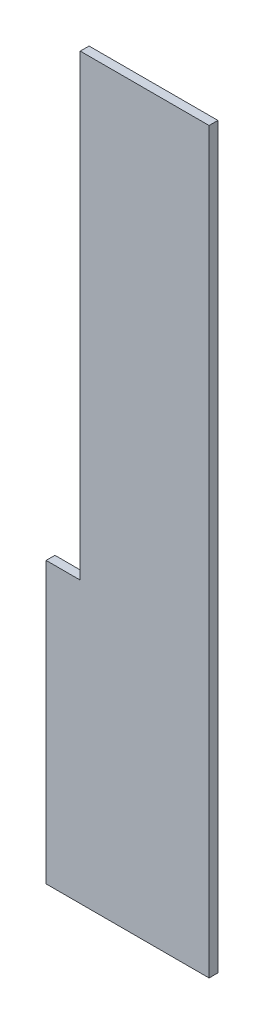
ISO-10303-21;
HEADER;
FILE_DESCRIPTION(('STEP AP214'),'2;1');
FILE_NAME('part.step','',(''),(''),'','','');
FILE_SCHEMA(('AUTOMOTIVE_DESIGN { 1 0 10303 214 1 1 1 1 }'));
ENDSEC;
DATA;
#1=APPLICATION_CONTEXT('core data for automotive mechanical design processes');
#2=APPLICATION_PROTOCOL_DEFINITION('international standard','automotive_design',2000,#1);
#3=PRODUCT_CONTEXT('',#1,'mechanical');
#4=PRODUCT('Part','Part','',(#3));
#5=PRODUCT_RELATED_PRODUCT_CATEGORY('part','',(#4));
#6=PRODUCT_DEFINITION_FORMATION('','',#4);
#7=PRODUCT_DEFINITION_CONTEXT('part definition',#1,'design');
#8=PRODUCT_DEFINITION('design','',#6,#7);
#9=PRODUCT_DEFINITION_SHAPE('','',#8);
#10=(LENGTH_UNIT() NAMED_UNIT(*) SI_UNIT(.MILLI.,.METRE.));
#11=(NAMED_UNIT(*) PLANE_ANGLE_UNIT() SI_UNIT($,.RADIAN.));
#12=(NAMED_UNIT(*) SI_UNIT($,.STERADIAN.) SOLID_ANGLE_UNIT());
#13=UNCERTAINTY_MEASURE_WITH_UNIT(LENGTH_MEASURE(1.E-05),#10,'distance_accuracy_value','');
#14=(GEOMETRIC_REPRESENTATION_CONTEXT(3) GLOBAL_UNCERTAINTY_ASSIGNED_CONTEXT((#13)) GLOBAL_UNIT_ASSIGNED_CONTEXT((#10,
#11,#12)) REPRESENTATION_CONTEXT('',''));
#15=CARTESIAN_POINT('',(0.,0.,0.));
#16=DIRECTION('',(0.,0.,1.));
#17=DIRECTION('',(1.,0.,0.));
#18=AXIS2_PLACEMENT_3D('',#15,#16,#17);
#19=CARTESIAN_POINT('',(4.24340115904558E-13,-3465.,-40.));
#20=DIRECTION('',(0.,1.,0.));
#21=DIRECTION('',(0.,0.,1.));
#22=AXIS2_PLACEMENT_3D('',#19,#20,#21);
#23=PLANE('',#22);
#24=DIRECTION('',(0.,0.,1.));
#25=VECTOR('',#24,1.);
#26=CARTESIAN_POINT('',(615.,-3465.,-40.));
#27=LINE('',#26,#25);
#28=CARTESIAN_POINT('',(615.,-3465.,-40.));
#29=VERTEX_POINT('',#28);
#30=CARTESIAN_POINT('',(615.,-3465.,0.));
#31=VERTEX_POINT('',#30);
#32=EDGE_CURVE('E126',#29,#31,#27,.T.);
#33=ORIENTED_EDGE('',*,*,#32,.T.);
#34=DIRECTION('',(-1.,0.,0.));
#35=VECTOR('',#34,1.);
#36=CARTESIAN_POINT('',(4.24340115904558E-13,-3465.,0.));
#37=LINE('',#36,#35);
#38=CARTESIAN_POINT('',(770.000000000001,-3465.,0.));
#39=VERTEX_POINT('',#38);
#40=EDGE_CURVE('E108',#39,#31,#37,.T.);
#41=ORIENTED_EDGE('',*,*,#40,.F.);
#42=DIRECTION('',(0.,0.,1.));
#43=VECTOR('',#42,1.);
#44=CARTESIAN_POINT('',(770.000000000001,-3465.,-40.));
#45=LINE('',#44,#43);
#46=CARTESIAN_POINT('',(770.000000000001,-3465.,-40.));
#47=VERTEX_POINT('',#46);
#48=EDGE_CURVE('E111',#47,#39,#45,.T.);
#49=ORIENTED_EDGE('',*,*,#48,.F.);
#50=DIRECTION('',(-1.,0.,0.));
#51=VECTOR('',#50,1.);
#52=CARTESIAN_POINT('',(4.24340115904558E-13,-3465.,-40.));
#53=LINE('',#52,#51);
#54=EDGE_CURVE('E45',#47,#29,#53,.T.);
#55=ORIENTED_EDGE('',*,*,#54,.T.);
#56=EDGE_LOOP('',(#33,#41,#49,#55));
#57=FACE_BOUND('',#56,.T.);
#58=ADVANCED_FACE('F38',(#57),#23,.T.);
#59=CARTESIAN_POINT('',(0.,0.,-40.));
#60=DIRECTION('',(0.,0.,1.));
#61=DIRECTION('',(1.,0.,0.));
#62=AXIS2_PLACEMENT_3D('',#59,#60,#61);
#63=PLANE('',#62);
#64=DIRECTION('',(0.,1.,0.));
#65=VECTOR('',#64,1.);
#66=CARTESIAN_POINT('',(770.,-355.,-40.));
#67=LINE('',#66,#65);
#68=CARTESIAN_POINT('',(770.000000000001,-1385.,-40.));
#69=VERTEX_POINT('',#68);
#70=EDGE_CURVE('E99',#47,#69,#67,.T.);
#71=ORIENTED_EDGE('',*,*,#70,.T.);
#72=DIRECTION('',(1.,0.,0.));
#73=VECTOR('',#72,1.);
#74=CARTESIAN_POINT('',(770.000000000001,-1385.,-40.));
#75=LINE('',#74,#73);
#76=CARTESIAN_POINT('',(1355.,-1385.,-40.));
#77=VERTEX_POINT('',#76);
#78=EDGE_CURVE('E52',#69,#77,#75,.T.);
#79=ORIENTED_EDGE('',*,*,#78,.T.);
#80=DIRECTION('',(0.,-1.,0.));
#81=VECTOR('',#80,1.);
#82=CARTESIAN_POINT('',(1355.,-355.,-40.));
#83=LINE('',#82,#81);
#84=CARTESIAN_POINT('',(1355.,-4737.,-40.));
#85=VERTEX_POINT('',#84);
#86=EDGE_CURVE('E59',#77,#85,#83,.T.);
#87=ORIENTED_EDGE('',*,*,#86,.T.);
#88=DIRECTION('',(-1.,0.,0.));
#89=VECTOR('',#88,1.);
#90=CARTESIAN_POINT('',(615.,-4737.,-40.));
#91=LINE('',#90,#89);
#92=CARTESIAN_POINT('',(615.,-4737.,-40.));
#93=VERTEX_POINT('',#92);
#94=EDGE_CURVE('E141',#85,#93,#91,.T.);
#95=ORIENTED_EDGE('',*,*,#94,.T.);
#96=DIRECTION('',(0.,1.,0.));
#97=VECTOR('',#96,1.);
#98=CARTESIAN_POINT('',(615.,-3465.,-40.));
#99=LINE('',#98,#97);
#100=EDGE_CURVE('E135',#93,#29,#99,.T.);
#101=ORIENTED_EDGE('',*,*,#100,.T.);
#102=ORIENTED_EDGE('',*,*,#54,.F.);
#103=EDGE_LOOP('',(#71,#79,#87,#95,#101,#102));
#104=FACE_BOUND('',#103,.T.);
#105=ADVANCED_FACE('F97',(#104),#63,.F.);
#106=CARTESIAN_POINT('',(0.,0.,0.));
#107=DIRECTION('',(0.,0.,1.));
#108=DIRECTION('',(1.,0.,0.));
#109=AXIS2_PLACEMENT_3D('',#106,#107,#108);
#110=PLANE('',#109);
#111=DIRECTION('',(1.,0.,0.));
#112=VECTOR('',#111,1.);
#113=CARTESIAN_POINT('',(0.,-1385.,0.));
#114=LINE('',#113,#112);
#115=CARTESIAN_POINT('',(770.000000000001,-1385.,0.));
#116=VERTEX_POINT('',#115);
#117=CARTESIAN_POINT('',(1355.,-1385.,0.));
#118=VERTEX_POINT('',#117);
#119=EDGE_CURVE('E91',#116,#118,#114,.T.);
#120=ORIENTED_EDGE('',*,*,#119,.F.);
#121=DIRECTION('',(0.,1.,0.));
#122=VECTOR('',#121,1.);
#123=CARTESIAN_POINT('',(770.,0.,0.));
#124=LINE('',#123,#122);
#125=EDGE_CURVE('E106',#39,#116,#124,.T.);
#126=ORIENTED_EDGE('',*,*,#125,.F.);
#127=ORIENTED_EDGE('',*,*,#40,.T.);
#128=DIRECTION('',(0.,1.,0.));
#129=VECTOR('',#128,1.);
#130=CARTESIAN_POINT('',(615.,0.,0.));
#131=LINE('',#130,#129);
#132=CARTESIAN_POINT('',(615.,-4737.,0.));
#133=VERTEX_POINT('',#132);
#134=EDGE_CURVE('E11',#133,#31,#131,.T.);
#135=ORIENTED_EDGE('',*,*,#134,.F.);
#136=DIRECTION('',(-1.,0.,0.));
#137=VECTOR('',#136,1.);
#138=CARTESIAN_POINT('',(0.,-4737.,0.));
#139=LINE('',#138,#137);
#140=CARTESIAN_POINT('',(1355.,-4737.,0.));
#141=VERTEX_POINT('',#140);
#142=EDGE_CURVE('E129',#141,#133,#139,.T.);
#143=ORIENTED_EDGE('',*,*,#142,.F.);
#144=DIRECTION('',(0.,-1.,0.));
#145=VECTOR('',#144,1.);
#146=CARTESIAN_POINT('',(1355.,2.13005621007729E-13,0.));
#147=LINE('',#146,#145);
#148=EDGE_CURVE('E105',#118,#141,#147,.T.);
#149=ORIENTED_EDGE('',*,*,#148,.F.);
#150=EDGE_LOOP('',(#120,#126,#127,#135,#143,#149));
#151=FACE_BOUND('',#150,.T.);
#152=ADVANCED_FACE('F120',(#151),#110,.T.);
#153=CARTESIAN_POINT('',(1355.,-355.,-40.));
#154=DIRECTION('',(-1.,0.,0.));
#155=DIRECTION('',(0.,-1.,0.));
#156=AXIS2_PLACEMENT_3D('',#153,#154,#155);
#157=PLANE('',#156);
#158=ORIENTED_EDGE('',*,*,#86,.F.);
#159=DIRECTION('',(0.,0.,1.));
#160=VECTOR('',#159,1.);
#161=CARTESIAN_POINT('',(1355.,-1385.,-40.));
#162=LINE('',#161,#160);
#163=EDGE_CURVE('E88',#77,#118,#162,.T.);
#164=ORIENTED_EDGE('',*,*,#163,.T.);
#165=ORIENTED_EDGE('',*,*,#148,.T.);
#166=DIRECTION('',(0.,0.,1.));
#167=VECTOR('',#166,1.);
#168=CARTESIAN_POINT('',(1355.,-4737.,-40.));
#169=LINE('',#168,#167);
#170=EDGE_CURVE('E104',#85,#141,#169,.T.);
#171=ORIENTED_EDGE('',*,*,#170,.F.);
#172=EDGE_LOOP('',(#158,#164,#165,#171));
#173=FACE_BOUND('',#172,.T.);
#174=ADVANCED_FACE('F102',(#173),#157,.F.);
#175=CARTESIAN_POINT('',(770.,-355.,-40.));
#176=DIRECTION('',(1.,0.,0.));
#177=DIRECTION('',(0.,1.,0.));
#178=AXIS2_PLACEMENT_3D('',#175,#176,#177);
#179=PLANE('',#178);
#180=ORIENTED_EDGE('',*,*,#125,.T.);
#181=DIRECTION('',(0.,0.,1.));
#182=VECTOR('',#181,1.);
#183=CARTESIAN_POINT('',(770.000000000001,-1385.,-40.));
#184=LINE('',#183,#182);
#185=EDGE_CURVE('E94',#69,#116,#184,.T.);
#186=ORIENTED_EDGE('',*,*,#185,.F.);
#187=ORIENTED_EDGE('',*,*,#70,.F.);
#188=ORIENTED_EDGE('',*,*,#48,.T.);
#189=EDGE_LOOP('',(#180,#186,#187,#188));
#190=FACE_BOUND('',#189,.T.);
#191=ADVANCED_FACE('F128',(#190),#179,.F.);
#192=CARTESIAN_POINT('',(615.,-3465.,-40.));
#193=DIRECTION('',(1.,0.,0.));
#194=DIRECTION('',(0.,1.,0.));
#195=AXIS2_PLACEMENT_3D('',#192,#193,#194);
#196=PLANE('',#195);
#197=ORIENTED_EDGE('',*,*,#134,.T.);
#198=ORIENTED_EDGE('',*,*,#32,.F.);
#199=ORIENTED_EDGE('',*,*,#100,.F.);
#200=DIRECTION('',(0.,0.,1.));
#201=VECTOR('',#200,1.);
#202=CARTESIAN_POINT('',(615.,-4737.,-40.));
#203=LINE('',#202,#201);
#204=EDGE_CURVE('E134',#93,#133,#203,.T.);
#205=ORIENTED_EDGE('',*,*,#204,.T.);
#206=EDGE_LOOP('',(#197,#198,#199,#205));
#207=FACE_BOUND('',#206,.T.);
#208=ADVANCED_FACE('F148',(#207),#196,.F.);
#209=CARTESIAN_POINT('',(615.,-4737.,-40.));
#210=DIRECTION('',(0.,1.,0.));
#211=DIRECTION('',(0.,0.,1.));
#212=AXIS2_PLACEMENT_3D('',#209,#210,#211);
#213=PLANE('',#212);
#214=ORIENTED_EDGE('',*,*,#142,.T.);
#215=ORIENTED_EDGE('',*,*,#204,.F.);
#216=ORIENTED_EDGE('',*,*,#94,.F.);
#217=ORIENTED_EDGE('',*,*,#170,.T.);
#218=EDGE_LOOP('',(#214,#215,#216,#217));
#219=FACE_BOUND('',#218,.T.);
#220=ADVANCED_FACE('F145',(#219),#213,.F.);
#221=CARTESIAN_POINT('',(770.000000000001,-1385.,-40.));
#222=DIRECTION('',(0.,-1.,0.));
#223=DIRECTION('',(0.,0.,-1.));
#224=AXIS2_PLACEMENT_3D('',#221,#222,#223);
#225=PLANE('',#224);
#226=ORIENTED_EDGE('',*,*,#119,.T.);
#227=ORIENTED_EDGE('',*,*,#163,.F.);
#228=ORIENTED_EDGE('',*,*,#78,.F.);
#229=ORIENTED_EDGE('',*,*,#185,.T.);
#230=EDGE_LOOP('',(#226,#227,#228,#229));
#231=FACE_BOUND('',#230,.T.);
#232=ADVANCED_FACE('F89',(#231),#225,.F.);
#233=CLOSED_SHELL('',(#58,#105,#152,#174,#191,#208,#220,#232));
#234=MANIFOLD_SOLID_BREP('B2',#233);
#235=ADVANCED_BREP_SHAPE_REPRESENTATION('',(#18,#234),#14);
#236=SHAPE_DEFINITION_REPRESENTATION(#9,#235);
ENDSEC;
END-ISO-10303-21;
